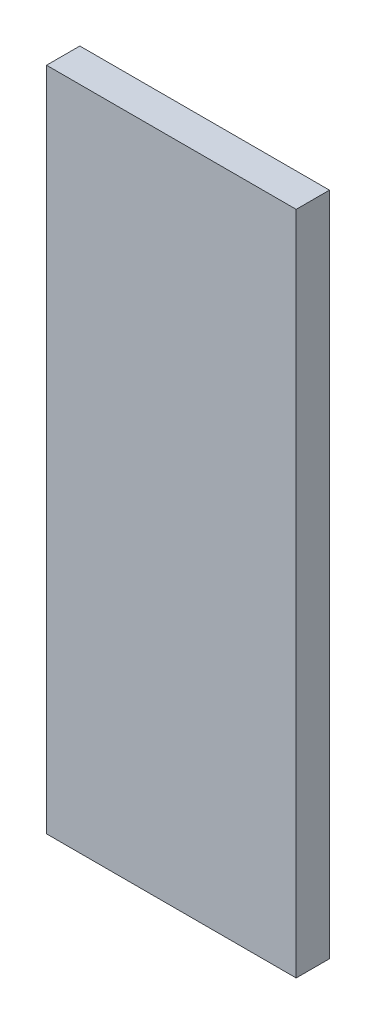
ISO-10303-21;
HEADER;
FILE_DESCRIPTION(('STEP AP214'),'2;1');
FILE_NAME('part.step','',(''),(''),'','','');
FILE_SCHEMA(('AUTOMOTIVE_DESIGN { 1 0 10303 214 1 1 1 1 }'));
ENDSEC;
DATA;
#1=APPLICATION_CONTEXT('core data for automotive mechanical design processes');
#2=APPLICATION_PROTOCOL_DEFINITION('international standard','automotive_design',2000,#1);
#3=PRODUCT_CONTEXT('',#1,'mechanical');
#4=PRODUCT('Part','Part','',(#3));
#5=PRODUCT_RELATED_PRODUCT_CATEGORY('part','',(#4));
#6=PRODUCT_DEFINITION_FORMATION('','',#4);
#7=PRODUCT_DEFINITION_CONTEXT('part definition',#1,'design');
#8=PRODUCT_DEFINITION('design','',#6,#7);
#9=PRODUCT_DEFINITION_SHAPE('','',#8);
#10=(LENGTH_UNIT() NAMED_UNIT(*) SI_UNIT(.MILLI.,.METRE.));
#11=(NAMED_UNIT(*) PLANE_ANGLE_UNIT() SI_UNIT($,.RADIAN.));
#12=(NAMED_UNIT(*) SI_UNIT($,.STERADIAN.) SOLID_ANGLE_UNIT());
#13=UNCERTAINTY_MEASURE_WITH_UNIT(LENGTH_MEASURE(1.E-05),#10,'distance_accuracy_value','');
#14=(GEOMETRIC_REPRESENTATION_CONTEXT(3) GLOBAL_UNCERTAINTY_ASSIGNED_CONTEXT((#13)) GLOBAL_UNIT_ASSIGNED_CONTEXT((#10,
#11,#12)) REPRESENTATION_CONTEXT('',''));
#15=CARTESIAN_POINT('',(0.,0.,0.));
#16=DIRECTION('',(0.,0.,1.));
#17=DIRECTION('',(1.,0.,0.));
#18=AXIS2_PLACEMENT_3D('',#15,#16,#17);
#19=CARTESIAN_POINT('',(15.,40.,4.));
#20=DIRECTION('',(-1.,0.,0.));
#21=DIRECTION('',(0.,-1.,0.));
#22=AXIS2_PLACEMENT_3D('',#19,#20,#21);
#23=PLANE('',#22);
#24=DIRECTION('',(0.,1.,0.));
#25=VECTOR('',#24,1.);
#26=CARTESIAN_POINT('',(15.,40.,0.));
#27=LINE('',#26,#25);
#28=CARTESIAN_POINT('',(15.,-40.,0.));
#29=VERTEX_POINT('',#28);
#30=CARTESIAN_POINT('',(15.,40.,0.));
#31=VERTEX_POINT('',#30);
#32=EDGE_CURVE('E103',#29,#31,#27,.T.);
#33=ORIENTED_EDGE('',*,*,#32,.T.);
#34=DIRECTION('',(0.,0.,-1.));
#35=VECTOR('',#34,1.);
#36=CARTESIAN_POINT('',(15.,40.,4.));
#37=LINE('',#36,#35);
#38=CARTESIAN_POINT('',(15.,40.,4.));
#39=VERTEX_POINT('',#38);
#40=EDGE_CURVE('E11',#39,#31,#37,.T.);
#41=ORIENTED_EDGE('',*,*,#40,.F.);
#42=DIRECTION('',(0.,1.,0.));
#43=VECTOR('',#42,1.);
#44=CARTESIAN_POINT('',(15.,40.,4.));
#45=LINE('',#44,#43);
#46=CARTESIAN_POINT('',(15.,-40.,4.));
#47=VERTEX_POINT('',#46);
#48=EDGE_CURVE('E91',#47,#39,#45,.T.);
#49=ORIENTED_EDGE('',*,*,#48,.F.);
#50=DIRECTION('',(0.,0.,-1.));
#51=VECTOR('',#50,1.);
#52=CARTESIAN_POINT('',(15.,-40.,4.));
#53=LINE('',#52,#51);
#54=EDGE_CURVE('E99',#47,#29,#53,.T.);
#55=ORIENTED_EDGE('',*,*,#54,.T.);
#56=EDGE_LOOP('',(#33,#41,#49,#55));
#57=FACE_BOUND('',#56,.T.);
#58=ADVANCED_FACE('F40',(#57),#23,.F.);
#59=CARTESIAN_POINT('',(-15.,40.,4.));
#60=DIRECTION('',(0.,-1.,0.));
#61=DIRECTION('',(0.,0.,-1.));
#62=AXIS2_PLACEMENT_3D('',#59,#60,#61);
#63=PLANE('',#62);
#64=DIRECTION('',(-1.,0.,0.));
#65=VECTOR('',#64,1.);
#66=CARTESIAN_POINT('',(-15.,40.,0.));
#67=LINE('',#66,#65);
#68=CARTESIAN_POINT('',(-15.,40.,0.));
#69=VERTEX_POINT('',#68);
#70=EDGE_CURVE('E95',#31,#69,#67,.T.);
#71=ORIENTED_EDGE('',*,*,#70,.T.);
#72=DIRECTION('',(0.,0.,-1.));
#73=VECTOR('',#72,1.);
#74=CARTESIAN_POINT('',(-15.,40.,4.));
#75=LINE('',#74,#73);
#76=CARTESIAN_POINT('',(-15.,40.,4.));
#77=VERTEX_POINT('',#76);
#78=EDGE_CURVE('E48',#77,#69,#75,.T.);
#79=ORIENTED_EDGE('',*,*,#78,.F.);
#80=DIRECTION('',(-1.,0.,0.));
#81=VECTOR('',#80,1.);
#82=CARTESIAN_POINT('',(-15.,40.,4.));
#83=LINE('',#82,#81);
#84=EDGE_CURVE('E86',#39,#77,#83,.T.);
#85=ORIENTED_EDGE('',*,*,#84,.F.);
#86=ORIENTED_EDGE('',*,*,#40,.T.);
#87=EDGE_LOOP('',(#71,#79,#85,#86));
#88=FACE_BOUND('',#87,.T.);
#89=ADVANCED_FACE('F94',(#88),#63,.F.);
#90=CARTESIAN_POINT('',(-15.,40.,4.));
#91=DIRECTION('',(1.,0.,0.));
#92=DIRECTION('',(0.,1.,0.));
#93=AXIS2_PLACEMENT_3D('',#90,#91,#92);
#94=PLANE('',#93);
#95=DIRECTION('',(0.,-1.,0.));
#96=VECTOR('',#95,1.);
#97=CARTESIAN_POINT('',(-15.,40.,0.));
#98=LINE('',#97,#96);
#99=CARTESIAN_POINT('',(-15.,-40.,0.));
#100=VERTEX_POINT('',#99);
#101=EDGE_CURVE('E73',#69,#100,#98,.T.);
#102=ORIENTED_EDGE('',*,*,#101,.T.);
#103=DIRECTION('',(0.,0.,-1.));
#104=VECTOR('',#103,1.);
#105=CARTESIAN_POINT('',(-15.,-40.,4.));
#106=LINE('',#105,#104);
#107=CARTESIAN_POINT('',(-15.,-40.,4.));
#108=VERTEX_POINT('',#107);
#109=EDGE_CURVE('E96',#108,#100,#106,.T.);
#110=ORIENTED_EDGE('',*,*,#109,.F.);
#111=DIRECTION('',(0.,-1.,0.));
#112=VECTOR('',#111,1.);
#113=CARTESIAN_POINT('',(-15.,40.,4.));
#114=LINE('',#113,#112);
#115=EDGE_CURVE('E89',#77,#108,#114,.T.);
#116=ORIENTED_EDGE('',*,*,#115,.F.);
#117=ORIENTED_EDGE('',*,*,#78,.T.);
#118=EDGE_LOOP('',(#102,#110,#116,#117));
#119=FACE_BOUND('',#118,.T.);
#120=ADVANCED_FACE('F97',(#119),#94,.F.);
#121=CARTESIAN_POINT('',(-15.,-40.,4.));
#122=DIRECTION('',(0.,1.,0.));
#123=DIRECTION('',(0.,0.,1.));
#124=AXIS2_PLACEMENT_3D('',#121,#122,#123);
#125=PLANE('',#124);
#126=DIRECTION('',(1.,0.,0.));
#127=VECTOR('',#126,1.);
#128=CARTESIAN_POINT('',(-15.,-40.,0.));
#129=LINE('',#128,#127);
#130=EDGE_CURVE('E79',#100,#29,#129,.T.);
#131=ORIENTED_EDGE('',*,*,#130,.T.);
#132=ORIENTED_EDGE('',*,*,#54,.F.);
#133=DIRECTION('',(1.,0.,0.));
#134=VECTOR('',#133,1.);
#135=CARTESIAN_POINT('',(-15.,-40.,4.));
#136=LINE('',#135,#134);
#137=EDGE_CURVE('E56',#108,#47,#136,.T.);
#138=ORIENTED_EDGE('',*,*,#137,.F.);
#139=ORIENTED_EDGE('',*,*,#109,.T.);
#140=EDGE_LOOP('',(#131,#132,#138,#139));
#141=FACE_BOUND('',#140,.T.);
#142=ADVANCED_FACE('F110',(#141),#125,.F.);
#143=CARTESIAN_POINT('',(0.,0.,4.));
#144=DIRECTION('',(0.,0.,1.));
#145=DIRECTION('',(1.,0.,0.));
#146=AXIS2_PLACEMENT_3D('',#143,#144,#145);
#147=PLANE('',#146);
#148=ORIENTED_EDGE('',*,*,#48,.T.);
#149=ORIENTED_EDGE('',*,*,#84,.T.);
#150=ORIENTED_EDGE('',*,*,#115,.T.);
#151=ORIENTED_EDGE('',*,*,#137,.T.);
#152=EDGE_LOOP('',(#148,#149,#150,#151));
#153=FACE_BOUND('',#152,.T.);
#154=ADVANCED_FACE('F87',(#153),#147,.T.);
#155=CARTESIAN_POINT('',(0.,0.,0.));
#156=DIRECTION('',(0.,0.,1.));
#157=DIRECTION('',(1.,0.,0.));
#158=AXIS2_PLACEMENT_3D('',#155,#156,#157);
#159=PLANE('',#158);
#160=ORIENTED_EDGE('',*,*,#32,.F.);
#161=ORIENTED_EDGE('',*,*,#130,.F.);
#162=ORIENTED_EDGE('',*,*,#101,.F.);
#163=ORIENTED_EDGE('',*,*,#70,.F.);
#164=EDGE_LOOP('',(#160,#161,#162,#163));
#165=FACE_BOUND('',#164,.T.);
#166=ADVANCED_FACE('F113',(#165),#159,.F.);
#167=CLOSED_SHELL('',(#58,#89,#120,#142,#154,#166));
#168=MANIFOLD_SOLID_BREP('B2',#167);
#169=ADVANCED_BREP_SHAPE_REPRESENTATION('',(#18,#168),#14);
#170=SHAPE_DEFINITION_REPRESENTATION(#9,#169);
ENDSEC;
END-ISO-10303-21;
